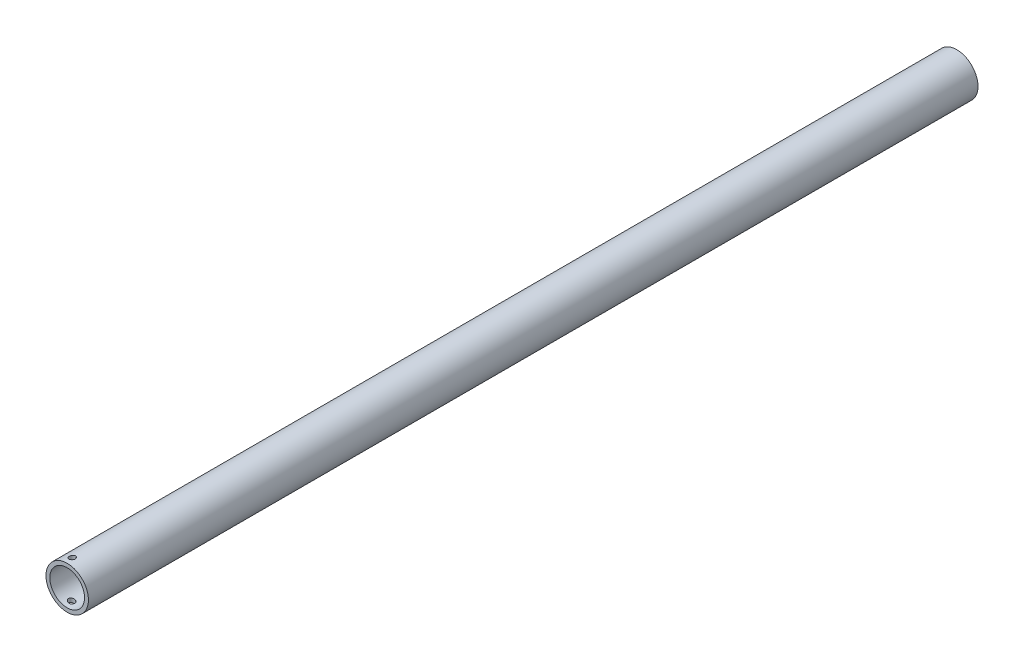
ISO-10303-21;
HEADER;
FILE_DESCRIPTION(('STEP AP214'),'2;1');
FILE_NAME('part.step','',(''),(''),'','','');
FILE_SCHEMA(('AUTOMOTIVE_DESIGN { 1 0 10303 214 1 1 1 1 }'));
ENDSEC;
DATA;
#1=APPLICATION_CONTEXT('core data for automotive mechanical design processes');
#2=APPLICATION_PROTOCOL_DEFINITION('international standard','automotive_design',2000,#1);
#3=PRODUCT_CONTEXT('',#1,'mechanical');
#4=PRODUCT('Part','Part','',(#3));
#5=PRODUCT_RELATED_PRODUCT_CATEGORY('part','',(#4));
#6=PRODUCT_DEFINITION_FORMATION('','',#4);
#7=PRODUCT_DEFINITION_CONTEXT('part definition',#1,'design');
#8=PRODUCT_DEFINITION('design','',#6,#7);
#9=PRODUCT_DEFINITION_SHAPE('','',#8);
#10=(LENGTH_UNIT() NAMED_UNIT(*) SI_UNIT(.MILLI.,.METRE.));
#11=(NAMED_UNIT(*) PLANE_ANGLE_UNIT() SI_UNIT($,.RADIAN.));
#12=(NAMED_UNIT(*) SI_UNIT($,.STERADIAN.) SOLID_ANGLE_UNIT());
#13=UNCERTAINTY_MEASURE_WITH_UNIT(LENGTH_MEASURE(1.E-05),#10,'distance_accuracy_value','');
#14=(GEOMETRIC_REPRESENTATION_CONTEXT(3) GLOBAL_UNCERTAINTY_ASSIGNED_CONTEXT((#13)) GLOBAL_UNIT_ASSIGNED_CONTEXT((#10,
#11,#12)) REPRESENTATION_CONTEXT('',''));
#15=CARTESIAN_POINT('',(0.,0.,0.));
#16=DIRECTION('',(0.,0.,1.));
#17=DIRECTION('',(1.,0.,0.));
#18=AXIS2_PLACEMENT_3D('',#15,#16,#17);
#19=CARTESIAN_POINT('',(0.,0.,461.));
#20=DIRECTION('',(0.,0.,1.));
#21=DIRECTION('',(1.,0.,0.));
#22=AXIS2_PLACEMENT_3D('',#19,#20,#21);
#23=PLANE('',#22);
#24=CARTESIAN_POINT('',(0.,0.,461.));
#25=DIRECTION('',(0.,0.,1.));
#26=DIRECTION('',(1.,0.,0.));
#27=AXIS2_PLACEMENT_3D('',#24,#25,#26);
#28=CIRCLE('',#27,11.);
#29=CARTESIAN_POINT('',(11.,0.,461.));
#30=VERTEX_POINT('',#29);
#31=EDGE_CURVE('E11',#30,#30,#28,.T.);
#32=ORIENTED_EDGE('',*,*,#31,.T.);
#33=EDGE_LOOP('',(#32));
#34=FACE_BOUND('',#33,.T.);
#35=CARTESIAN_POINT('',(0.,0.,461.));
#36=DIRECTION('',(0.,0.,1.));
#37=DIRECTION('',(1.,0.,0.));
#38=AXIS2_PLACEMENT_3D('',#35,#36,#37);
#39=CIRCLE('',#38,9.);
#40=CARTESIAN_POINT('',(9.,0.,461.));
#41=VERTEX_POINT('',#40);
#42=EDGE_CURVE('E56',#41,#41,#39,.T.);
#43=ORIENTED_EDGE('',*,*,#42,.F.);
#44=EDGE_LOOP('',(#43));
#45=FACE_BOUND('',#44,.T.);
#46=ADVANCED_FACE('F39',(#34,#45),#23,.T.);
#47=CARTESIAN_POINT('',(0.,0.,0.));
#48=DIRECTION('',(0.,0.,1.));
#49=DIRECTION('',(1.,0.,0.));
#50=AXIS2_PLACEMENT_3D('',#47,#48,#49);
#51=PLANE('',#50);
#52=CARTESIAN_POINT('',(0.,0.,0.));
#53=DIRECTION('',(0.,0.,1.));
#54=DIRECTION('',(1.,0.,0.));
#55=AXIS2_PLACEMENT_3D('',#52,#53,#54);
#56=CIRCLE('',#55,11.);
#57=CARTESIAN_POINT('',(11.,0.,0.));
#58=VERTEX_POINT('',#57);
#59=EDGE_CURVE('E51',#58,#58,#56,.T.);
#60=ORIENTED_EDGE('',*,*,#59,.F.);
#61=EDGE_LOOP('',(#60));
#62=FACE_BOUND('',#61,.T.);
#63=CARTESIAN_POINT('',(0.,0.,0.));
#64=DIRECTION('',(0.,0.,1.));
#65=DIRECTION('',(1.,0.,0.));
#66=AXIS2_PLACEMENT_3D('',#63,#64,#65);
#67=CIRCLE('',#66,9.);
#68=CARTESIAN_POINT('',(9.,0.,0.));
#69=VERTEX_POINT('',#68);
#70=EDGE_CURVE('E59',#69,#69,#67,.T.);
#71=ORIENTED_EDGE('',*,*,#70,.T.);
#72=EDGE_LOOP('',(#71));
#73=FACE_BOUND('',#72,.T.);
#74=ADVANCED_FACE('F92',(#62,#73),#51,.F.);
#75=CARTESIAN_POINT('',(0.,0.,461.));
#76=DIRECTION('',(0.,0.,-1.));
#77=DIRECTION('',(-1.,0.,0.));
#78=AXIS2_PLACEMENT_3D('',#75,#76,#77);
#79=CYLINDRICAL_SURFACE('',#78,11.);
#80=CARTESIAN_POINT('',(-3.31019821458482,-10.4901185779837,457.));
#81=CARTESIAN_POINT('',(-3.31019428179106,-10.490120745091,457.087469557946));
#82=CARTESIAN_POINT('',(-3.30302839900126,-10.4923893657661,457.174991694408));
#83=CARTESIAN_POINT('',(-3.2746020041344,-10.5012948811817,457.34754165717));
#84=CARTESIAN_POINT('',(-3.25332722289327,-10.5079361982398,457.432566867174));
#85=CARTESIAN_POINT('',(-3.19745736271634,-10.5250706778891,457.597551308309));
#86=CARTESIAN_POINT('',(-3.16288332908442,-10.5355577535708,457.677518312121));
#87=CARTESIAN_POINT('',(-3.08151781871866,-10.5596420394337,457.830432841133));
#88=CARTESIAN_POINT('',(-3.03472708517951,-10.5732390604172,457.903380792965));
#89=CARTESIAN_POINT('',(-2.92905587236614,-10.6030045638496,458.042094389418));
#90=CARTESIAN_POINT('',(-2.86992022256382,-10.6192253609099,458.107654276215));
#91=CARTESIAN_POINT('',(-2.74187591823054,-10.6530040491576,458.228006720359));
#92=CARTESIAN_POINT('',(-2.67296536488629,-10.6705621998235,458.282797180758));
#93=CARTESIAN_POINT('',(-2.52470635536137,-10.7066269103503,458.381900773259));
#94=CARTESIAN_POINT('',(-2.44508696373624,-10.7251455909319,458.425804814957));
#95=CARTESIAN_POINT('',(-2.27942347654741,-10.7615712615729,458.499486307712));
#96=CARTESIAN_POINT('',(-2.19337902030062,-10.7794782172096,458.529262965011));
#97=CARTESIAN_POINT('',(-2.01668079378181,-10.8139327351195,458.573897478249));
#98=CARTESIAN_POINT('',(-1.92600317824224,-10.8304718080121,458.588667779015));
#99=CARTESIAN_POINT('',(-1.74309737331219,-10.8614091879654,458.60239551993));
#100=CARTESIAN_POINT('',(-1.65086935627331,-10.8758077312509,458.601354706273));
#101=CARTESIAN_POINT('',(-1.46925094141748,-10.901815001895,458.583483108244));
#102=CARTESIAN_POINT('',(-1.37983927602685,-10.9134689297941,458.566934437112));
#103=CARTESIAN_POINT('',(-1.20484657898098,-10.9341716529282,458.518794954456));
#104=CARTESIAN_POINT('',(-1.11926517396239,-10.9432207025487,458.487205612564));
#105=CARTESIAN_POINT('',(-0.955960859509353,-10.9586842050841,458.410500184282));
#106=CARTESIAN_POINT('',(-0.878127830572929,-10.9651414245711,458.365626912316));
#107=CARTESIAN_POINT('',(-0.730966053683342,-10.9759345945343,458.263414012199));
#108=CARTESIAN_POINT('',(-0.661637130348447,-10.9802705887623,458.206074641206));
#109=CARTESIAN_POINT('',(-0.5337426750846,-10.9872296581869,458.080784062258));
#110=CARTESIAN_POINT('',(-0.475139053296319,-10.9898588830483,458.012872058052));
#111=CARTESIAN_POINT('',(-0.37006309127273,-10.993899515886,457.868202894431));
#112=CARTESIAN_POINT('',(-0.323590962146368,-10.9953109026708,457.791445581127));
#113=CARTESIAN_POINT('',(-0.24395118965324,-10.9973673331813,457.630949972747));
#114=CARTESIAN_POINT('',(-0.210833338526088,-10.9980095261318,457.547186932003));
#115=CARTESIAN_POINT('',(-0.159091349824981,-10.9988801570942,457.375295793653));
#116=CARTESIAN_POINT('',(-0.140467353243683,-10.9991085910811,457.287167653592));
#117=CARTESIAN_POINT('',(-0.118218861043399,-10.9993704803096,457.108843974331));
#118=CARTESIAN_POINT('',(-0.114626755862499,-10.9994035145706,457.018644391391));
#119=CARTESIAN_POINT('',(-0.122633733536103,-10.9993170726071,456.838921821369));
#120=CARTESIAN_POINT('',(-0.13423290476633,-10.9991975954952,456.749398838226));
#121=CARTESIAN_POINT('',(-0.172294398476098,-10.9986668692905,456.57355595796));
#122=CARTESIAN_POINT('',(-0.198759107438182,-10.9982555733469,456.48723657751));
#123=CARTESIAN_POINT('',(-0.265797802192387,-10.9968390363116,456.320266699302));
#124=CARTESIAN_POINT('',(-0.306371853043716,-10.9958337924811,456.239616227687));
#125=CARTESIAN_POINT('',(-0.400452495428086,-10.9928087155513,456.086302760571));
#126=CARTESIAN_POINT('',(-0.453955064212667,-10.9907891978361,456.013637290724));
#127=CARTESIAN_POINT('',(-0.572355503908851,-10.9852588232639,455.878339319258));
#128=CARTESIAN_POINT('',(-0.637253092566623,-10.9817480033434,455.815706569203));
#129=CARTESIAN_POINT('',(-0.776355250667067,-10.9727893760722,455.702419432864));
#130=CARTESIAN_POINT('',(-0.850533306582195,-10.9673470087197,455.651732064116));
#131=CARTESIAN_POINT('',(-1.00615920222849,-10.9541650954338,455.563534596849));
#132=CARTESIAN_POINT('',(-1.08760673659352,-10.9464256459611,455.526023945147));
#133=CARTESIAN_POINT('',(-1.25510708112542,-10.9284844584538,455.465281299773));
#134=CARTESIAN_POINT('',(-1.34114441990392,-10.9182906302226,455.442004271122));
#135=CARTESIAN_POINT('',(-1.51557131152173,-10.8954475920591,455.41008537244));
#136=CARTESIAN_POINT('',(-1.60396091985109,-10.8827983241586,455.401443847972));
#137=CARTESIAN_POINT('',(-1.7811467996851,-10.8552109229286,455.398881391654));
#138=CARTESIAN_POINT('',(-1.86994223039947,-10.8402591957278,455.405051288935));
#139=CARTESIAN_POINT('',(-2.044972090723,-10.8086078845527,455.431974728645));
#140=CARTESIAN_POINT('',(-2.13120623566674,-10.7919081072237,455.452729885829));
#141=CARTESIAN_POINT('',(-2.30043491309823,-10.7571187719204,455.508673850285));
#142=CARTESIAN_POINT('',(-2.38333786018187,-10.7390089647121,455.544127099955));
#143=CARTESIAN_POINT('',(-2.54195995772517,-10.7025730993147,455.628461388512));
#144=CARTESIAN_POINT('',(-2.61767833929526,-10.6842470182154,455.677343862413));
#145=CARTESIAN_POINT('',(-2.76105257773853,-10.6481052959247,455.788130628763));
#146=CARTESIAN_POINT('',(-2.82856293059459,-10.6303022127344,455.850227599121));
#147=CARTESIAN_POINT('',(-2.95219733420296,-10.5966337593957,455.985365342874));
#148=CARTESIAN_POINT('',(-3.00831934677109,-10.5807687363059,456.058408071184));
#149=CARTESIAN_POINT('',(-3.10691679911507,-10.5522359478728,456.212677285105));
#150=CARTESIAN_POINT('',(-3.14952519432009,-10.5395373131998,456.293813006953));
#151=CARTESIAN_POINT('',(-3.22038435065676,-10.5181038734996,456.462544411233));
#152=CARTESIAN_POINT('',(-3.24865429243116,-10.5093637747979,456.550131283229));
#153=CARTESIAN_POINT('',(-3.28283060319712,-10.4987244342631,456.698549887905));
#154=CARTESIAN_POINT('',(-3.29307527900084,-10.4955088859505,456.758324859273));
#155=CARTESIAN_POINT('',(-3.3067603092154,-10.4912052499345,456.878724817317));
#156=CARTESIAN_POINT('',(-3.31020094153183,-10.4901170753403,456.939349769173));
#157=CARTESIAN_POINT('',(-3.31019821458482,-10.4901185779837,457.));
#158=B_SPLINE_CURVE_WITH_KNOTS('',3,(#80,#81,#82,#83,#84,#85,#86,#87,#88,#89,#90,#91,#92,#93,
#94,#95,#96,#97,#98,#99,#100,#101,#102,#103,#104,#105,#106,#107,#108,#109,#110,#111,#112,#113,
#114,#115,#116,#117,#118,#119,#120,#121,#122,#123,#124,#125,#126,#127,#128,#129,#130,#131,#132,
#133,#134,#135,#136,#137,#138,#139,#140,#141,#142,#143,#144,#145,#146,#147,#148,#149,#150,#151,
#152,#153,#154,#155,#156,#157),.UNSPECIFIED.,.T.,.F.,(4,2,2,2,2,2,2,2,2,2,2,2,2,2,2,2,2,2,2,2,2,
2,2,2,2,2,2,2,2,2,2,2,2,2,2,2,2,2,4),(0.,0.262182301181903,0.524630168045843,0.786664423483586,
1.04868274195721,1.31677653258658,1.58492247298431,1.86198701845764,2.13906712917998,
2.41775474818112,2.69641158888113,2.97009562618412,3.24375292714862,3.51268817417289,
3.78161787396339,4.04957313366333,4.31753305593726,4.58648304456566,4.8554356494408,
5.12496749088625,5.39450090034852,5.66407759251617,5.93365552773817,6.20314969071419,
6.47263717928046,6.74137163050008,7.01009479840538,7.27796327026714,7.54583806675736,
7.81535976283755,8.08491130274523,8.35953881209189,8.63419567890314,8.91317145936031,
9.19219712447915,9.46838566930354,9.74420377398351,9.92600492834038,10.1077986570248),.UNSPECIFIED.);
#159=CARTESIAN_POINT('',(-3.31019821458482,-10.4901185779837,457.));
#160=VERTEX_POINT('',#159);
#161=EDGE_CURVE('E82',#160,#160,#158,.T.);
#162=ORIENTED_EDGE('',*,*,#161,.T.);
#163=EDGE_LOOP('',(#162));
#164=FACE_BOUND('',#163,.T.);
#165=CARTESIAN_POINT('',(-3.01385311028662,10.5790684575541,457.));
#166=CARTESIAN_POINT('',(-3.01384911809852,10.5790705131939,456.912530442054));
#167=CARTESIAN_POINT('',(-3.00662226487027,10.5811366952628,456.825008305592));
#168=CARTESIAN_POINT('',(-2.97795664666281,10.5892391925771,456.65245834283));
#169=CARTESIAN_POINT('',(-2.95650349378613,10.595279527069,456.567433132826));
#170=CARTESIAN_POINT('',(-2.90017382616122,10.6108358831432,456.402448691691));
#171=CARTESIAN_POINT('',(-2.86531851958651,10.6203464121252,456.322481687879));
#172=CARTESIAN_POINT('',(-2.78330782357778,10.6421327574536,456.169567158867));
#173=CARTESIAN_POINT('',(-2.73615318236564,10.6544084055796,456.096619207036));
#174=CARTESIAN_POINT('',(-2.62968661416582,10.681190120756,455.957905610582));
#175=CARTESIAN_POINT('',(-2.57011814623904,10.6957413050263,455.892345723785));
#176=CARTESIAN_POINT('',(-2.4411744658434,10.725905372026,455.771993279641));
#177=CARTESIAN_POINT('',(-2.37179734801457,10.7415184607269,455.717202819242));
#178=CARTESIAN_POINT('',(-2.22258266453568,10.7733991050896,455.618099226741));
#179=CARTESIAN_POINT('',(-2.14247392972372,10.789671156591,455.574195185043));
#180=CARTESIAN_POINT('',(-1.97585150155917,10.8214231156134,455.500513692288));
#181=CARTESIAN_POINT('',(-1.88933744863432,10.836902978581,455.470737034989));
#182=CARTESIAN_POINT('',(-1.71174008522597,10.8663742114989,455.426102521751));
#183=CARTESIAN_POINT('',(-1.62063317767252,10.8803564247763,455.411332220985));
#184=CARTESIAN_POINT('',(-1.43692961135605,10.9061373223188,455.39760448007));
#185=CARTESIAN_POINT('',(-1.34433311823261,10.9179362475626,455.398645293727));
#186=CARTESIAN_POINT('',(-1.16205509252712,10.9388251940659,455.416516891756));
#187=CARTESIAN_POINT('',(-1.07235102951493,10.9479597998324,455.433065562888));
#188=CARTESIAN_POINT('',(-0.896845291484847,10.9637326462169,455.481205045544));
#189=CARTESIAN_POINT('',(-0.811043236096689,10.9703711306189,455.512794387436));
#190=CARTESIAN_POINT('',(-0.647368610465258,10.9812355659032,455.589499815718));
#191=CARTESIAN_POINT('',(-0.569384761467967,10.9855011693177,455.634373087684));
#192=CARTESIAN_POINT('',(-0.421977641159498,10.9921511300333,455.736585987801));
#193=CARTESIAN_POINT('',(-0.35255419330544,10.9945355261365,455.793925358794));
#194=CARTESIAN_POINT('',(-0.224514607143488,10.9978947983752,455.919215937742));
#195=CARTESIAN_POINT('',(-0.16586022108426,10.9988747504618,455.987127941949));
#196=CARTESIAN_POINT('',(-0.0607121827399172,10.999958513003,456.131797105569));
#197=CARTESIAN_POINT('',(-0.0142187420762383,11.000062308212,456.208554418873));
#198=CARTESIAN_POINT('',(0.0654473631231232,10.9998780487111,456.369050027253));
#199=CARTESIAN_POINT('',(0.098570174938105,10.9995885447653,456.452813067997));
#200=CARTESIAN_POINT('',(0.150316181667643,10.999003582745,456.624704206347));
#201=CARTESIAN_POINT('',(0.168939235532108,10.9987081246126,456.712832346408));
#202=CARTESIAN_POINT('',(0.191186292137488,10.9983441691879,456.891156025669));
#203=CARTESIAN_POINT('',(0.194777905413501,10.9982761620661,456.981355608609));
#204=CARTESIAN_POINT('',(0.186771664022184,10.9984149513402,457.161078178631));
#205=CARTESIAN_POINT('',(0.175173720989138,10.9986217493349,457.250601161774));
#206=CARTESIAN_POINT('',(0.137112357254717,10.9991617163701,457.42644404204));
#207=CARTESIAN_POINT('',(0.110646549697181,10.9994949056984,457.512763422491));
#208=CARTESIAN_POINT('',(0.043594534458402,10.999964398977,457.679733300698));
#209=CARTESIAN_POINT('',(0.00300826166665909,11.0001007020195,457.760383772314));
#210=CARTESIAN_POINT('',(-0.0911202440535754,10.9997228491867,457.913697239429));
#211=CARTESIAN_POINT('',(-0.144658446954757,10.9992088954306,457.986362709277));
#212=CARTESIAN_POINT('',(-0.263167591091132,10.9970107327378,458.121660680742));
#213=CARTESIAN_POINT('',(-0.328138249145307,10.9953265527846,458.184293430797));
#214=CARTESIAN_POINT('',(-0.467437342264566,10.9902837314574,458.297580567137));
#215=CARTESIAN_POINT('',(-0.541739121290076,10.9869297822341,458.348267935884));
#216=CARTESIAN_POINT('',(-0.697674195687416,10.9781300773365,458.436465403151));
#217=CARTESIAN_POINT('',(-0.779307183100946,10.9726844094965,458.473976054853));
#218=CARTESIAN_POINT('',(-0.947245864044409,10.9594612831475,458.534718700227));
#219=CARTESIAN_POINT('',(-1.03353586984229,10.9516912961787,458.557995728878));
#220=CARTESIAN_POINT('',(-1.2085362228434,10.9337630681156,458.58991462756));
#221=CARTESIAN_POINT('',(-1.29724662714507,10.9236047706368,458.598556152028));
#222=CARTESIAN_POINT('',(-1.47513831261982,10.9010116531421,458.601118608346));
#223=CARTESIAN_POINT('',(-1.56431913566419,10.888563220985,458.594948711065));
#224=CARTESIAN_POINT('',(-1.74016995239651,10.8618471629197,458.568025271355));
#225=CARTESIAN_POINT('',(-1.82683966696979,10.8475793357269,458.547270114171));
#226=CARTESIAN_POINT('',(-1.99697985293363,10.8175633360558,458.491326149715));
#227=CARTESIAN_POINT('',(-2.08035934466196,10.8017923465053,458.455872900045));
#228=CARTESIAN_POINT('',(-2.23994345540475,10.7698321569764,458.371538611488));
#229=CARTESIAN_POINT('',(-2.31614730647815,10.7536429124718,458.322656137587));
#230=CARTESIAN_POINT('',(-2.46048131719986,10.7215479021383,458.211869371237));
#231=CARTESIAN_POINT('',(-2.52846567719579,10.7056505970279,458.149772400879));
#232=CARTESIAN_POINT('',(-2.65299810100632,10.6754726924337,458.014634657126));
#233=CARTESIAN_POINT('',(-2.70954411768195,10.6611923825471,457.941591928816));
#234=CARTESIAN_POINT('',(-2.80890505348135,10.635443944506,457.787322714895));
#235=CARTESIAN_POINT('',(-2.85185374364157,10.623948698618,457.706186993047));
#236=CARTESIAN_POINT('',(-2.92328768650616,10.6045166585565,457.537455588767));
#237=CARTESIAN_POINT('',(-2.95179226115074,10.5965751122604,457.449868716771));
#238=CARTESIAN_POINT('',(-2.98625428465835,10.5869011926645,457.301450112095));
#239=CARTESIAN_POINT('',(-2.99658534539817,10.5839750489114,457.241675140727));
#240=CARTESIAN_POINT('',(-3.01038600215771,10.5800580081996,457.121275182683));
#241=CARTESIAN_POINT('',(-3.01385587841688,10.5790670322007,457.060650230827));
#242=CARTESIAN_POINT('',(-3.01385311028662,10.5790684575541,457.));
#243=B_SPLINE_CURVE_WITH_KNOTS('',3,(#165,#166,#167,#168,#169,#170,#171,#172,#173,#174,#175,
#176,#177,#178,#179,#180,#181,#182,#183,#184,#185,#186,#187,#188,#189,#190,#191,#192,#193,#194,
#195,#196,#197,#198,#199,#200,#201,#202,#203,#204,#205,#206,#207,#208,#209,#210,#211,#212,#213,
#214,#215,#216,#217,#218,#219,#220,#221,#222,#223,#224,#225,#226,#227,#228,#229,#230,#231,#232,
#233,#234,#235,#236,#237,#238,#239,#240,#241,#242),.UNSPECIFIED.,.T.,.F.,(4,2,2,2,2,2,2,2,2,2,2,
2,2,2,2,2,2,2,2,2,2,2,2,2,2,2,2,2,2,2,2,2,2,2,2,2,2,2,4),(0.,0.26218230118196,0.524630168045843,
0.786664423483525,1.04868274195721,1.31677653258658,1.58492247298431,1.86198701845764,
2.13906712917998,2.41775474818111,2.69641158888113,2.97009562618415,3.24375292714862,
3.51268817417289,3.78161787396339,4.04957313366345,4.31753305593726,4.5864830445656,
4.8554356494408,5.12496749088625,5.39450090034852,5.66407759251617,5.93365552773817,
6.20314969071425,6.47263717928045,6.74137163050015,7.01009479840538,7.27796327026714,
7.54583806675736,7.81535976283756,8.08491130274523,8.35953881209194,8.63419567890318,
8.9131714593603,9.19219712447915,9.46838566930354,9.74420377398351,9.92600492834038,
10.1077986570248),.UNSPECIFIED.);
#244=CARTESIAN_POINT('',(-3.01385311028662,10.5790684575541,457.));
#245=VERTEX_POINT('',#244);
#246=EDGE_CURVE('E44',#245,#245,#243,.T.);
#247=ORIENTED_EDGE('',*,*,#246,.T.);
#248=EDGE_LOOP('',(#247));
#249=FACE_BOUND('',#248,.T.);
#250=ORIENTED_EDGE('',*,*,#31,.F.);
#251=EDGE_LOOP('',(#250));
#252=FACE_BOUND('',#251,.T.);
#253=ORIENTED_EDGE('',*,*,#59,.T.);
#254=EDGE_LOOP('',(#253));
#255=FACE_BOUND('',#254,.T.);
#256=ADVANCED_FACE('F41',(#164,#249,#252,#255),#79,.T.);
#257=CARTESIAN_POINT('',(0.,0.,461.));
#258=DIRECTION('',(0.,0.,-1.));
#259=DIRECTION('',(-1.,0.,0.));
#260=AXIS2_PLACEMENT_3D('',#257,#258,#259);
#261=CYLINDRICAL_SURFACE('',#260,9.);
#262=CARTESIAN_POINT('',(-3.28053021168357,-8.38081866706537,457.));
#263=CARTESIAN_POINT('',(-3.28052642214357,-8.38082121891264,457.086258545325));
#264=CARTESIAN_POINT('',(-3.27356286202026,-8.38355621684367,457.172563329816));
#265=CARTESIAN_POINT('',(-3.24597015408209,-8.39427705309789,457.342668437859));
#266=CARTESIAN_POINT('',(-3.22532831248983,-8.40226776880362,457.426466359413));
#267=CARTESIAN_POINT('',(-3.17121476483831,-8.42283956198027,457.588996450559));
#268=CARTESIAN_POINT('',(-3.13777052889757,-8.43541080823729,457.667739047828));
#269=CARTESIAN_POINT('',(-3.05917452591665,-8.4642303710155,457.818382982768));
#270=CARTESIAN_POINT('',(-3.01402251958159,-8.48047876269292,457.890284180566));
#271=CARTESIAN_POINT('',(-2.91157071258361,-8.51620761173969,458.027996912753));
#272=CARTESIAN_POINT('',(-2.85390465574833,-8.53578044587828,458.093511671641));
#273=CARTESIAN_POINT('',(-2.72898635558418,-8.57653465041155,458.214069596927));
#274=CARTESIAN_POINT('',(-2.66173158062881,-8.5977164449139,458.26910998888));
#275=CARTESIAN_POINT('',(-2.51563296610189,-8.64162546993121,458.370004165715));
#276=CARTESIAN_POINT('',(-2.43637313107661,-8.66437643905742,458.41524664013));
#277=CARTESIAN_POINT('',(-2.27111505590698,-8.70915385759835,458.491597248104));
#278=CARTESIAN_POINT('',(-2.18511616276964,-8.7311802365083,458.522704009969));
#279=CARTESIAN_POINT('',(-2.00778422623815,-8.77366443418201,458.570019452634));
#280=CARTESIAN_POINT('',(-1.91640762419923,-8.79410501494143,458.586081079686));
#281=CARTESIAN_POINT('',(-1.73170572252985,-8.83233163605896,458.602065211848));
#282=CARTESIAN_POINT('',(-1.63838075858884,-8.85011812946526,458.601990474567));
#283=CARTESIAN_POINT('',(-1.45510154216345,-8.88206654291592,458.585659101984));
#284=CARTESIAN_POINT('',(-1.36512362311548,-8.89631222656216,458.569832565069));
#285=CARTESIAN_POINT('',(-1.18877756735504,-8.92158856760139,458.522891740181));
#286=CARTESIAN_POINT('',(-1.10240888583705,-8.93261971173377,458.491779768617));
#287=CARTESIAN_POINT('',(-0.938192049936575,-8.95133824009628,458.416080782459));
#288=CARTESIAN_POINT('',(-0.860179626037724,-8.95910587952113,458.371869377567));
#289=CARTESIAN_POINT('',(-0.712491481287564,-8.97205988271747,458.270921240826));
#290=CARTESIAN_POINT('',(-0.642815485307394,-8.97724633169437,458.214184922516));
#291=CARTESIAN_POINT('',(-0.514244485563661,-8.98552662354724,458.090160443881));
#292=CARTESIAN_POINT('',(-0.455288847345816,-8.98863252050922,458.022935897376));
#293=CARTESIAN_POINT('',(-0.349351843413857,-8.99337385715967,457.879588996373));
#294=CARTESIAN_POINT('',(-0.30237077856416,-8.9950092599042,457.803466418378));
#295=CARTESIAN_POINT('',(-0.221497330517219,-8.9973658567717,457.644024785958));
#296=CARTESIAN_POINT('',(-0.187677481910299,-8.99808203318922,457.560668862685));
#297=CARTESIAN_POINT('',(-0.134453232515764,-8.99903528636168,457.389472446377));
#298=CARTESIAN_POINT('',(-0.115049049699867,-8.99927235587239,457.301631885553));
#299=CARTESIAN_POINT('',(-0.0911678794805954,-8.99954634422612,457.123645333169));
#300=CARTESIAN_POINT('',(-0.0867407689119492,-8.99958259455351,457.033492643826));
#301=CARTESIAN_POINT('',(-0.0930803379373871,-8.99951917142969,456.853722745376));
#302=CARTESIAN_POINT('',(-0.103847145442845,-8.99941949683419,456.764105540783));
#303=CARTESIAN_POINT('',(-0.140271762008604,-8.99892503695538,456.587925860172));
#304=CARTESIAN_POINT('',(-0.165933546186946,-8.99853017288488,456.501364206152));
#305=CARTESIAN_POINT('',(-0.23141770206796,-8.99708351477401,456.333778244332));
#306=CARTESIAN_POINT('',(-0.271240181294172,-8.99603171574543,456.252753978583));
#307=CARTESIAN_POINT('',(-0.363883007654971,-8.99275975401167,456.098582425334));
#308=CARTESIAN_POINT('',(-0.416697940423679,-8.9905400775602,456.025431874816));
#309=CARTESIAN_POINT('',(-0.533801113937161,-8.98434661349005,455.889062562958));
#310=CARTESIAN_POINT('',(-0.598088941956558,-8.98037288896383,455.825843444498));
#311=CARTESIAN_POINT('',(-0.735961397364523,-8.97012320026778,455.711377614289));
#312=CARTESIAN_POINT('',(-0.809507385059318,-8.9638566094573,455.660083529256));
#313=CARTESIAN_POINT('',(-0.963905310293799,-8.94856945229992,455.570577123934));
#314=CARTESIAN_POINT('',(-1.04475679484071,-8.93954905662613,455.532363993235));
#315=CARTESIAN_POINT('',(-1.210937190894,-8.918554002348,455.470171938998));
#316=CARTESIAN_POINT('',(-1.29624229057306,-8.90659399647638,455.446124366356));
#317=CARTESIAN_POINT('',(-1.46919609729128,-8.87970270979279,455.412487744799));
#318=CARTESIAN_POINT('',(-1.55684487666235,-8.86477133718506,455.402899142649));
#319=CARTESIAN_POINT('',(-1.73276236100031,-8.83207823518593,455.398210886349));
#320=CARTESIAN_POINT('',(-1.82103002091097,-8.81429358056895,455.403234773903));
#321=CARTESIAN_POINT('',(-1.99506829922636,-8.77653907775335,455.427668069867));
#322=CARTESIAN_POINT('',(-2.08083853941398,-8.7565689007291,455.447079645537));
#323=CARTESIAN_POINT('',(-2.25002263725487,-8.71465450212317,455.500327078658));
#324=CARTESIAN_POINT('',(-2.33330604162144,-8.69267099946606,455.534546411435));
#325=CARTESIAN_POINT('',(-2.4928473066235,-8.64827026286458,455.616452110224));
#326=CARTESIAN_POINT('',(-2.56910385299665,-8.62585294872753,455.664140988747));
#327=CARTESIAN_POINT('',(-2.7144737729829,-8.58123312823508,455.773146108385));
#328=CARTESIAN_POINT('',(-2.78335930715055,-8.55905019820855,455.834774867017));
#329=CARTESIAN_POINT('',(-2.90979362387318,-8.51689808319025,455.969423871178));
#330=CARTESIAN_POINT('',(-2.96734038608903,-8.49692929298993,456.042446142653));
#331=CARTESIAN_POINT('',(-3.06860114299518,-8.4608833638137,456.197017794193));
#332=CARTESIAN_POINT('',(-3.11248119112939,-8.44476011492269,456.278447388282));
#333=CARTESIAN_POINT('',(-3.18574155872448,-8.41739841068027,456.448278259315));
#334=CARTESIAN_POINT('',(-3.21514279576367,-8.40615291124939,456.53666926352));
#335=CARTESIAN_POINT('',(-3.2512241364048,-8.39224481337156,456.687998796435));
#336=CARTESIAN_POINT('',(-3.26219089089354,-8.38797783539607,456.749802362254));
#337=CARTESIAN_POINT('',(-3.2768450342236,-8.38226393929003,456.874395828419));
#338=CARTESIAN_POINT('',(-3.28053297126496,-8.38081680878435,456.937185654126));
#339=CARTESIAN_POINT('',(-3.28053021168357,-8.38081866706537,457.));
#340=B_SPLINE_CURVE_WITH_KNOTS('',3,(#262,#263,#264,#265,#266,#267,#268,#269,#270,#271,#272,
#273,#274,#275,#276,#277,#278,#279,#280,#281,#282,#283,#284,#285,#286,#287,#288,#289,#290,#291,
#292,#293,#294,#295,#296,#297,#298,#299,#300,#301,#302,#303,#304,#305,#306,#307,#308,#309,#310,
#311,#312,#313,#314,#315,#316,#317,#318,#319,#320,#321,#322,#323,#324,#325,#326,#327,#328,#329,
#330,#331,#332,#333,#334,#335,#336,#337,#338,#339),.UNSPECIFIED.,.T.,.F.,(4,2,2,2,2,2,2,2,2,2,2,
2,2,2,2,2,2,2,2,2,2,2,2,2,2,2,2,2,2,2,2,2,2,2,2,2,2,2,4),(0.,0.258538187428959,
0.517316641221858,0.775542918171926,1.03377447341981,1.30094074502333,1.5681776853068,
1.8490370905645,2.1299237439239,2.41352803084907,2.69708385149088,2.97310397181586,
3.24908227596244,3.51780789861134,3.78652465000492,4.05367075286973,4.32082356719159,
4.58942854999331,4.85803759414736,5.12754028760479,5.39704524990856,5.66662216982326,
5.93620113670553,6.20566795126295,6.47512507398759,6.7434927295548,7.011843755823,
7.27888336670113,7.54593122863384,7.81524339955894,8.08459614604913,8.36138609680622,
8.63822771210038,8.92203075093168,9.20588431206874,9.48614075588528,9.76599111587466,
9.95427542212816,10.1425455473139),.UNSPECIFIED.);
#341=CARTESIAN_POINT('',(-3.28053021168357,-8.38081866706537,457.));
#342=VERTEX_POINT('',#341);
#343=EDGE_CURVE('E67',#342,#342,#340,.T.);
#344=ORIENTED_EDGE('',*,*,#343,.F.);
#345=EDGE_LOOP('',(#344));
#346=FACE_BOUND('',#345,.T.);
#347=CARTESIAN_POINT('',(-3.04352111318787,8.46976854663571,457.));
#348=CARTESIAN_POINT('',(-3.04351725337601,8.46977099089232,456.913741454675));
#349=CARTESIAN_POINT('',(-3.03647952587102,8.47230905606863,456.827436670185));
#350=CARTESIAN_POINT('',(-3.00859620871613,8.48224960362853,456.657331562141));
#351=CARTESIAN_POINT('',(-2.98773779313347,8.48965660445148,456.573533640587));
#352=CARTESIAN_POINT('',(-2.933067068472,8.50869831075433,456.411003549441));
#353=CARTESIAN_POINT('',(-2.89928249514867,8.52032396150928,456.332260952172));
#354=CARTESIAN_POINT('',(-2.81990703080502,8.54692160320047,456.181617017232));
#355=CARTESIAN_POINT('',(-2.77431589847069,8.56189366253304,456.109715819434));
#356=CARTESIAN_POINT('',(-2.6708997428376,8.59472691039905,455.972003087247));
#357=CARTESIAN_POINT('',(-2.61270601014754,8.61267013816731,455.906488328359));
#358=CARTESIAN_POINT('',(-2.48669091022036,8.64989488119376,455.785930403073));
#359=CARTESIAN_POINT('',(-2.41886700043017,8.6691767491896,455.73089001112));
#360=CARTESIAN_POINT('',(-2.27159123519704,8.70895936624338,455.629995834285));
#361=CARTESIAN_POINT('',(-2.19172288121274,8.72947214460839,455.58475335987));
#362=CARTESIAN_POINT('',(-2.02527081095182,8.76958394992568,455.508402751896));
#363=CARTESIAN_POINT('',(-1.93868644392347,8.78918288803559,455.477295990031));
#364=CARTESIAN_POINT('',(-1.76022978565024,8.82666280110841,455.429980547366));
#365=CARTESIAN_POINT('',(-1.66831443781249,8.84452531979491,455.413918920314));
#366=CARTESIAN_POINT('',(-1.48261047464089,8.87754205955994,455.397934788152));
#367=CARTESIAN_POINT('',(-1.38882218212168,8.89269674294871,455.398009525433));
#368=CARTESIAN_POINT('',(-1.20471691660978,8.91947777179959,455.414340898016));
#369=CARTESIAN_POINT('',(-1.11437393055611,8.93118718210318,455.430167434931));
#370=CARTESIAN_POINT('',(-0.937386735727284,8.95149377377234,455.477108259819));
#371=CARTESIAN_POINT('',(-0.850741968672526,8.96009142636203,455.508220231383));
#372=CARTESIAN_POINT('',(-0.686063634652293,8.97418393506518,455.583919217541));
#373=CARTESIAN_POINT('',(-0.607863605968317,8.97975439452882,455.628130622433));
#374=CARTESIAN_POINT('',(-0.459869552375262,8.98854952952776,455.729078759174));
#375=CARTESIAN_POINT('',(-0.390075250049745,8.99177428249673,455.785815077484));
#376=CARTESIAN_POINT('',(-0.261322227529364,8.99643522662215,455.909839556119));
#377=CARTESIAN_POINT('',(-0.202302557844171,8.9978817617461,455.977064102624));
#378=CARTESIAN_POINT('',(-0.0962741108457127,8.99964173402034,456.120411003627));
#379=CARTESIAN_POINT('',(-0.04926563531689,8.99995514270313,456.196533581622));
#380=CARTESIAN_POINT('',(0.0316420996165891,9.00003623356924,456.355975214042));
#381=CARTESIAN_POINT('',(0.0654687120013297,8.9998009400746,456.439331137315));
#382=CARTESIAN_POINT('',(0.118698716816352,8.99925687885076,456.610527553623));
#383=CARTESIAN_POINT('',(0.138101891157398,8.99894811001067,456.698368114447));
#384=CARTESIAN_POINT('',(0.161981320201652,8.99855032969358,456.876354666831));
#385=CARTESIAN_POINT('',(0.166407698998772,8.99846205275634,456.966507356174));
#386=CARTESIAN_POINT('',(0.160068854054479,8.99857695573043,457.146277254624));
#387=CARTESIAN_POINT('',(0.149303502420135,8.99878013809544,457.235894459217));
#388=CARTESIAN_POINT('',(0.112879388293406,8.99931031977773,457.412074139828));
#389=CARTESIAN_POINT('',(0.0872166500395823,8.99963735213956,457.498635793848));
#390=CARTESIAN_POINT('',(0.0217177115575074,9.00003301469796,457.666221755668));
#391=CARTESIAN_POINT('',(-0.0181185962920414,9.00010164293241,457.747246021417));
#392=CARTESIAN_POINT('',(-0.11081679843232,8.99943656424207,457.901417574666));
#393=CARTESIAN_POINT('',(-0.163673266823099,8.99870319109909,457.974568125184));
#394=CARTESIAN_POINT('',(-0.280904307418789,8.99580571547898,458.110937437043));
#395=CARTESIAN_POINT('',(-0.345278465287111,8.99364166446141,458.174156555502));
#396=CARTESIAN_POINT('',(-0.483384653401358,8.98727370692854,458.288622385711));
#397=CARTESIAN_POINT('',(-0.55707779561228,8.98307808331936,458.339916470744));
#398=CARTESIAN_POINT('',(-0.711844595562174,8.97213943057156,458.429422876066));
#399=CARTESIAN_POINT('',(-0.792917795687371,8.96539655929804,458.467636006765));
#400=CARTESIAN_POINT('',(-0.959622940615354,8.94908365057186,458.529828061002));
#401=CARTESIAN_POINT('',(-1.04523067090094,8.93952759034543,458.553875633644));
#402=CARTESIAN_POINT('',(-1.21887237913008,8.9175112845452,458.587512255201));
#403=CARTESIAN_POINT('',(-1.30690643195869,8.90505094924631,458.597100857351));
#404=CARTESIAN_POINT('',(-1.48367382204167,8.87731847699138,458.601789113651));
#405=CARTESIAN_POINT('',(-1.57240675942749,8.86202339448643,458.596765226097));
#406=CARTESIAN_POINT('',(-1.74743803928148,8.82917867079275,458.572331930133));
#407=CARTESIAN_POINT('',(-1.83373601293041,8.81162869027109,458.552920354463));
#408=CARTESIAN_POINT('',(-2.0040320300518,8.77448919208756,458.499672921342));
#409=CARTESIAN_POINT('',(-2.08790077662757,8.75485673987778,458.465453588565));
#410=CARTESIAN_POINT('',(-2.24862770401034,8.71496068163506,458.383547889776));
#411=CARTESIAN_POINT('',(-2.32548457333032,8.69469695847741,458.335859011253));
#412=CARTESIAN_POINT('',(-2.47205192347958,8.65418333252492,458.226853891615));
#413=CARTESIAN_POINT('',(-2.54153410440795,8.63394659030774,458.165225132983));
#414=CARTESIAN_POINT('',(-2.66910393754556,8.59536712791033,458.030576128822));
#415=CARTESIAN_POINT('',(-2.72718955911136,8.57702474554314,457.957553857347));
#416=CARTESIAN_POINT('',(-2.82942405372887,8.54384104457892,457.802982205807));
#417=CARTESIAN_POINT('',(-2.87374021138154,8.52895830457694,457.721552611718));
#418=CARTESIAN_POINT('',(-2.94774114864114,8.50366787943384,457.551721740685));
#419=CARTESIAN_POINT('',(-2.97744703566704,8.49325374130876,457.46333073648));
#420=CARTESIAN_POINT('',(-3.01390526956613,8.48036593660819,457.312001203565));
#421=CARTESIAN_POINT('',(-3.02498769490838,8.47640908766073,457.250197637746));
#422=CARTESIAN_POINT('',(-3.03979674511816,8.47110960114475,457.125604171581));
#423=CARTESIAN_POINT('',(-3.04352392394194,8.46976676670331,457.062814345874));
#424=CARTESIAN_POINT('',(-3.04352111318787,8.46976854663571,457.));
#425=B_SPLINE_CURVE_WITH_KNOTS('',3,(#347,#348,#349,#350,#351,#352,#353,#354,#355,#356,#357,
#358,#359,#360,#361,#362,#363,#364,#365,#366,#367,#368,#369,#370,#371,#372,#373,#374,#375,#376,
#377,#378,#379,#380,#381,#382,#383,#384,#385,#386,#387,#388,#389,#390,#391,#392,#393,#394,#395,
#396,#397,#398,#399,#400,#401,#402,#403,#404,#405,#406,#407,#408,#409,#410,#411,#412,#413,#414,
#415,#416,#417,#418,#419,#420,#421,#422,#423,#424),.UNSPECIFIED.,.T.,.F.,(4,2,2,2,2,2,2,2,2,2,2,
2,2,2,2,2,2,2,2,2,2,2,2,2,2,2,2,2,2,2,2,2,2,2,2,2,2,2,4),(0.,0.258538187428959,
0.517316641221858,0.775542918171926,1.03377447341981,1.30094074502333,1.5681776853068,
1.84903709056446,2.1299237439239,2.41352803084907,2.69708385149088,2.97310397181586,
3.24908227596244,3.51780789861141,3.78652465000492,4.05367075286981,4.32082356719158,
4.58942854999331,4.85803759414736,5.12754028760501,5.39704524990856,5.66662216982326,
5.93620113670553,6.20566795126295,6.47512507398759,6.74349272955485,7.01184375582301,
7.27888336670113,7.54593122863385,7.81524339955895,8.08459614604913,8.36138609680623,
8.63822771210039,8.9220307509317,9.20588431206879,9.48614075588528,9.7659911158746,
9.95427542212817,10.1425455473139),.UNSPECIFIED.);
#426=CARTESIAN_POINT('',(-3.04352111318787,8.46976854663571,457.));
#427=VERTEX_POINT('',#426);
#428=EDGE_CURVE('E62',#427,#427,#425,.T.);
#429=ORIENTED_EDGE('',*,*,#428,.F.);
#430=EDGE_LOOP('',(#429));
#431=FACE_BOUND('',#430,.T.);
#432=ORIENTED_EDGE('',*,*,#42,.T.);
#433=EDGE_LOOP('',(#432));
#434=FACE_BOUND('',#433,.T.);
#435=ORIENTED_EDGE('',*,*,#70,.F.);
#436=EDGE_LOOP('',(#435));
#437=FACE_BOUND('',#436,.T.);
#438=ADVANCED_FACE('F70',(#346,#431,#434,#437),#261,.F.);
#439=CARTESIAN_POINT('',(-1.719047690692,-11.1305396727197,457.));
#440=DIRECTION('',(0.0140639406088241,0.999901097896463,0.));
#441=DIRECTION('',(-0.999901097896463,0.0140639406088241,0.));
#442=AXIS2_PLACEMENT_3D('',#439,#440,#441);
#443=CYLINDRICAL_SURFACE('',#442,1.59999999999996);
#444=ORIENTED_EDGE('',*,*,#428,.T.);
#445=EDGE_LOOP('',(#444));
#446=FACE_BOUND('',#445,.T.);
#447=ORIENTED_EDGE('',*,*,#246,.F.);
#448=EDGE_LOOP('',(#447));
#449=FACE_BOUND('',#448,.T.);
#450=ADVANCED_FACE('F76',(#446,#449),#443,.F.);
#451=ORIENTED_EDGE('',*,*,#343,.T.);
#452=EDGE_LOOP('',(#451));
#453=FACE_BOUND('',#452,.T.);
#454=ORIENTED_EDGE('',*,*,#161,.F.);
#455=EDGE_LOOP('',(#454));
#456=FACE_BOUND('',#455,.T.);
#457=ADVANCED_FACE('F73',(#453,#456),#443,.F.);
#458=CLOSED_SHELL('',(#46,#74,#256,#438,#450,#457));
#459=MANIFOLD_SOLID_BREP('B2',#458);
#460=ADVANCED_BREP_SHAPE_REPRESENTATION('',(#18,#459),#14);
#461=SHAPE_DEFINITION_REPRESENTATION(#9,#460);
ENDSEC;
END-ISO-10303-21;
